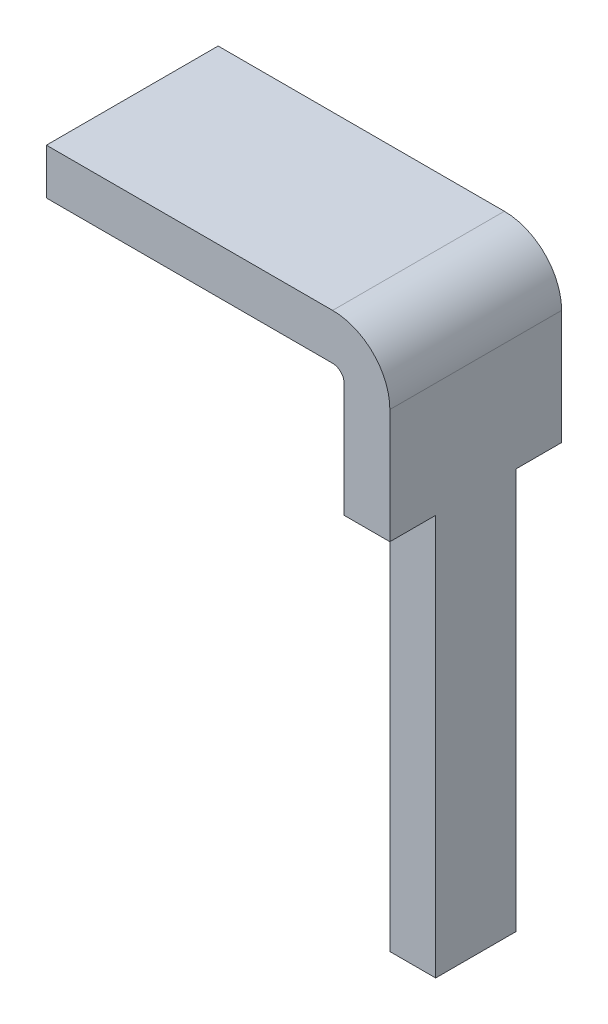
ISO-10303-21;
HEADER;
FILE_DESCRIPTION(('STEP AP214'),'2;1');
FILE_NAME('part.step','',(''),(''),'','','');
FILE_SCHEMA(('AUTOMOTIVE_DESIGN { 1 0 10303 214 1 1 1 1 }'));
ENDSEC;
DATA;
#1=APPLICATION_CONTEXT('core data for automotive mechanical design processes');
#2=APPLICATION_PROTOCOL_DEFINITION('international standard','automotive_design',2000,#1);
#3=PRODUCT_CONTEXT('',#1,'mechanical');
#4=PRODUCT('Part','Part','',(#3));
#5=PRODUCT_RELATED_PRODUCT_CATEGORY('part','',(#4));
#6=PRODUCT_DEFINITION_FORMATION('','',#4);
#7=PRODUCT_DEFINITION_CONTEXT('part definition',#1,'design');
#8=PRODUCT_DEFINITION('design','',#6,#7);
#9=PRODUCT_DEFINITION_SHAPE('','',#8);
#10=(LENGTH_UNIT() NAMED_UNIT(*) SI_UNIT(.MILLI.,.METRE.));
#11=(NAMED_UNIT(*) PLANE_ANGLE_UNIT() SI_UNIT($,.RADIAN.));
#12=(NAMED_UNIT(*) SI_UNIT($,.STERADIAN.) SOLID_ANGLE_UNIT());
#13=UNCERTAINTY_MEASURE_WITH_UNIT(LENGTH_MEASURE(1.E-05),#10,'distance_accuracy_value','');
#14=(GEOMETRIC_REPRESENTATION_CONTEXT(3) GLOBAL_UNCERTAINTY_ASSIGNED_CONTEXT((#13)) GLOBAL_UNIT_ASSIGNED_CONTEXT((#10,
#11,#12)) REPRESENTATION_CONTEXT('',''));
#15=CARTESIAN_POINT('',(0.,0.,0.));
#16=DIRECTION('',(0.,0.,1.));
#17=DIRECTION('',(1.,0.,0.));
#18=AXIS2_PLACEMENT_3D('',#15,#16,#17);
#19=CARTESIAN_POINT('',(0.,0.,1.5));
#20=DIRECTION('',(1.,0.,0.));
#21=DIRECTION('',(0.,0.,-1.));
#22=AXIS2_PLACEMENT_3D('',#19,#20,#21);
#23=PLANE('',#22);
#24=DIRECTION('',(0.,-1.,0.));
#25=VECTOR('',#24,1.);
#26=CARTESIAN_POINT('',(0.,0.,0.));
#27=LINE('',#26,#25);
#28=CARTESIAN_POINT('',(0.,0.,0.));
#29=VERTEX_POINT('',#28);
#30=CARTESIAN_POINT('',(0.,-0.4,0.));
#31=VERTEX_POINT('',#30);
#32=EDGE_CURVE('E189',#29,#31,#27,.T.);
#33=ORIENTED_EDGE('',*,*,#32,.T.);
#34=DIRECTION('',(0.,0.,-1.));
#35=VECTOR('',#34,1.);
#36=CARTESIAN_POINT('',(0.,-0.4,1.5));
#37=LINE('',#36,#35);
#38=CARTESIAN_POINT('',(0.,-0.4,1.5));
#39=VERTEX_POINT('',#38);
#40=EDGE_CURVE('E169',#39,#31,#37,.T.);
#41=ORIENTED_EDGE('',*,*,#40,.F.);
#42=DIRECTION('',(0.,-1.,0.));
#43=VECTOR('',#42,1.);
#44=CARTESIAN_POINT('',(0.,0.,1.5));
#45=LINE('',#44,#43);
#46=CARTESIAN_POINT('',(0.,0.,1.5));
#47=VERTEX_POINT('',#46);
#48=EDGE_CURVE('E148',#47,#39,#45,.T.);
#49=ORIENTED_EDGE('',*,*,#48,.F.);
#50=DIRECTION('',(0.,0.,-1.));
#51=VECTOR('',#50,1.);
#52=CARTESIAN_POINT('',(0.,0.,1.5));
#53=LINE('',#52,#51);
#54=EDGE_CURVE('E149',#47,#29,#53,.T.);
#55=ORIENTED_EDGE('',*,*,#54,.T.);
#56=EDGE_LOOP('',(#33,#41,#49,#55));
#57=FACE_BOUND('',#56,.T.);
#58=ADVANCED_FACE('F33',(#57),#23,.F.);
#59=CARTESIAN_POINT('',(0.,-0.4,1.5));
#60=DIRECTION('',(0.,1.,0.));
#61=DIRECTION('',(0.,0.,1.));
#62=AXIS2_PLACEMENT_3D('',#59,#60,#61);
#63=PLANE('',#62);
#64=DIRECTION('',(1.,0.,0.));
#65=VECTOR('',#64,1.);
#66=CARTESIAN_POINT('',(0.,-0.4,0.));
#67=LINE('',#66,#65);
#68=CARTESIAN_POINT('',(2.5,-0.4,0.));
#69=VERTEX_POINT('',#68);
#70=EDGE_CURVE('E192',#31,#69,#67,.T.);
#71=ORIENTED_EDGE('',*,*,#70,.T.);
#72=DIRECTION('',(0.,0.,-1.));
#73=VECTOR('',#72,1.);
#74=CARTESIAN_POINT('',(2.5,-0.4,1.5));
#75=LINE('',#74,#73);
#76=CARTESIAN_POINT('',(2.5,-0.4,1.5));
#77=VERTEX_POINT('',#76);
#78=EDGE_CURVE('E166',#77,#69,#75,.T.);
#79=ORIENTED_EDGE('',*,*,#78,.F.);
#80=DIRECTION('',(1.,0.,0.));
#81=VECTOR('',#80,1.);
#82=CARTESIAN_POINT('',(0.,-0.4,1.5));
#83=LINE('',#82,#81);
#84=EDGE_CURVE('E215',#39,#77,#83,.T.);
#85=ORIENTED_EDGE('',*,*,#84,.F.);
#86=ORIENTED_EDGE('',*,*,#40,.T.);
#87=EDGE_LOOP('',(#71,#79,#85,#86));
#88=FACE_BOUND('',#87,.T.);
#89=ADVANCED_FACE('F219',(#88),#63,.F.);
#90=CARTESIAN_POINT('',(2.5,-0.5,1.5));
#91=DIRECTION('',(0.,0.,-1.));
#92=DIRECTION('',(-1.,0.,0.));
#93=AXIS2_PLACEMENT_3D('',#90,#91,#92);
#94=CYLINDRICAL_SURFACE('',#93,0.0999999999999999);
#95=CARTESIAN_POINT('',(2.5,-0.5,0.));
#96=DIRECTION('',(0.,0.,-1.));
#97=DIRECTION('',(-1.,0.,0.));
#98=AXIS2_PLACEMENT_3D('',#95,#96,#97);
#99=CIRCLE('',#98,0.0999999999999999);
#100=CARTESIAN_POINT('',(2.6,-0.500000000000001,0.));
#101=VERTEX_POINT('',#100);
#102=EDGE_CURVE('E143',#69,#101,#99,.T.);
#103=ORIENTED_EDGE('',*,*,#102,.T.);
#104=DIRECTION('',(0.,0.,-1.));
#105=VECTOR('',#104,1.);
#106=CARTESIAN_POINT('',(2.6,-0.500000000000001,1.5));
#107=LINE('',#106,#105);
#108=CARTESIAN_POINT('',(2.6,-0.500000000000001,1.5));
#109=VERTEX_POINT('',#108);
#110=EDGE_CURVE('E163',#109,#101,#107,.T.);
#111=ORIENTED_EDGE('',*,*,#110,.F.);
#112=CARTESIAN_POINT('',(2.5,-0.5,1.5));
#113=DIRECTION('',(0.,0.,-1.));
#114=DIRECTION('',(-1.,0.,0.));
#115=AXIS2_PLACEMENT_3D('',#112,#113,#114);
#116=CIRCLE('',#115,0.0999999999999999);
#117=EDGE_CURVE('E184',#77,#109,#116,.T.);
#118=ORIENTED_EDGE('',*,*,#117,.F.);
#119=ORIENTED_EDGE('',*,*,#78,.T.);
#120=EDGE_LOOP('',(#103,#111,#118,#119));
#121=FACE_BOUND('',#120,.T.);
#122=ADVANCED_FACE('F197',(#121),#94,.F.);
#123=CARTESIAN_POINT('',(2.6,-0.500000000000001,1.5));
#124=DIRECTION('',(1.,0.,0.));
#125=DIRECTION('',(0.,0.,-1.));
#126=AXIS2_PLACEMENT_3D('',#123,#124,#125);
#127=PLANE('',#126);
#128=DIRECTION('',(0.,0.,1.));
#129=VECTOR('',#128,1.);
#130=CARTESIAN_POINT('',(2.6,-1.5,1.5));
#131=LINE('',#130,#129);
#132=CARTESIAN_POINT('',(2.6,-1.5,0.));
#133=VERTEX_POINT('',#132);
#134=CARTESIAN_POINT('',(2.6,-1.5,0.400000000000001));
#135=VERTEX_POINT('',#134);
#136=EDGE_CURVE('E46',#133,#135,#131,.T.);
#137=ORIENTED_EDGE('',*,*,#136,.T.);
#138=DIRECTION('',(0.,-1.,0.));
#139=VECTOR('',#138,1.);
#140=CARTESIAN_POINT('',(2.6,-0.500000000000001,0.400000000000001));
#141=LINE('',#140,#139);
#142=CARTESIAN_POINT('',(2.6,-5.,0.400000000000001));
#143=VERTEX_POINT('',#142);
#144=EDGE_CURVE('E258',#135,#143,#141,.T.);
#145=ORIENTED_EDGE('',*,*,#144,.T.);
#146=DIRECTION('',(0.,0.,-1.));
#147=VECTOR('',#146,1.);
#148=CARTESIAN_POINT('',(2.6,-5.,1.5));
#149=LINE('',#148,#147);
#150=CARTESIAN_POINT('',(2.6,-5.,1.1));
#151=VERTEX_POINT('',#150);
#152=EDGE_CURVE('E160',#151,#143,#149,.T.);
#153=ORIENTED_EDGE('',*,*,#152,.F.);
#154=DIRECTION('',(0.,1.,0.));
#155=VECTOR('',#154,1.);
#156=CARTESIAN_POINT('',(2.6,-0.500000000000001,1.1));
#157=LINE('',#156,#155);
#158=CARTESIAN_POINT('',(2.6,-1.5,1.1));
#159=VERTEX_POINT('',#158);
#160=EDGE_CURVE('E193',#151,#159,#157,.T.);
#161=ORIENTED_EDGE('',*,*,#160,.T.);
#162=DIRECTION('',(0.,0.,1.));
#163=VECTOR('',#162,1.);
#164=CARTESIAN_POINT('',(2.6,-1.5,1.5));
#165=LINE('',#164,#163);
#166=CARTESIAN_POINT('',(2.6,-1.5,1.5));
#167=VERTEX_POINT('',#166);
#168=EDGE_CURVE('E203',#159,#167,#165,.T.);
#169=ORIENTED_EDGE('',*,*,#168,.T.);
#170=DIRECTION('',(0.,-1.,0.));
#171=VECTOR('',#170,1.);
#172=CARTESIAN_POINT('',(2.6,-0.500000000000001,1.5));
#173=LINE('',#172,#171);
#174=EDGE_CURVE('E177',#109,#167,#173,.T.);
#175=ORIENTED_EDGE('',*,*,#174,.F.);
#176=ORIENTED_EDGE('',*,*,#110,.T.);
#177=DIRECTION('',(0.,-1.,0.));
#178=VECTOR('',#177,1.);
#179=CARTESIAN_POINT('',(2.6,-0.500000000000001,0.));
#180=LINE('',#179,#178);
#181=EDGE_CURVE('E139',#101,#133,#180,.T.);
#182=ORIENTED_EDGE('',*,*,#181,.T.);
#183=EDGE_LOOP('',(#137,#145,#153,#161,#169,#175,#176,#182));
#184=FACE_BOUND('',#183,.T.);
#185=ADVANCED_FACE('F201',(#184),#127,.F.);
#186=CARTESIAN_POINT('',(3.,-5.,1.5));
#187=DIRECTION('',(0.,1.,0.));
#188=DIRECTION('',(-1.,0.,0.));
#189=AXIS2_PLACEMENT_3D('',#186,#187,#188);
#190=PLANE('',#189);
#191=ORIENTED_EDGE('',*,*,#152,.T.);
#192=DIRECTION('',(1.,0.,0.));
#193=VECTOR('',#192,1.);
#194=CARTESIAN_POINT('',(1.5,-5.,0.400000000000001));
#195=LINE('',#194,#193);
#196=CARTESIAN_POINT('',(3.,-5.,0.400000000000001));
#197=VERTEX_POINT('',#196);
#198=EDGE_CURVE('E256',#143,#197,#195,.T.);
#199=ORIENTED_EDGE('',*,*,#198,.T.);
#200=DIRECTION('',(0.,0.,-1.));
#201=VECTOR('',#200,1.);
#202=CARTESIAN_POINT('',(3.,-5.,1.5));
#203=LINE('',#202,#201);
#204=CARTESIAN_POINT('',(3.,-5.,1.1));
#205=VERTEX_POINT('',#204);
#206=EDGE_CURVE('E158',#205,#197,#203,.T.);
#207=ORIENTED_EDGE('',*,*,#206,.F.);
#208=DIRECTION('',(1.,0.,0.));
#209=VECTOR('',#208,1.);
#210=CARTESIAN_POINT('',(1.5,-5.,1.1));
#211=LINE('',#210,#209);
#212=EDGE_CURVE('E209',#151,#205,#211,.T.);
#213=ORIENTED_EDGE('',*,*,#212,.F.);
#214=EDGE_LOOP('',(#191,#199,#207,#213));
#215=FACE_BOUND('',#214,.T.);
#216=ADVANCED_FACE('F236',(#215),#190,.F.);
#217=CARTESIAN_POINT('',(3.,-0.500000000000003,1.5));
#218=DIRECTION('',(-1.,0.,0.));
#219=DIRECTION('',(0.,-1.,0.));
#220=AXIS2_PLACEMENT_3D('',#217,#218,#219);
#221=PLANE('',#220);
#222=ORIENTED_EDGE('',*,*,#206,.T.);
#223=DIRECTION('',(0.,-1.,0.));
#224=VECTOR('',#223,1.);
#225=CARTESIAN_POINT('',(3.,-5.,0.400000000000001));
#226=LINE('',#225,#224);
#227=CARTESIAN_POINT('',(3.,-1.5,0.400000000000001));
#228=VERTEX_POINT('',#227);
#229=EDGE_CURVE('E133',#228,#197,#226,.T.);
#230=ORIENTED_EDGE('',*,*,#229,.F.);
#231=DIRECTION('',(0.,0.,1.));
#232=VECTOR('',#231,1.);
#233=CARTESIAN_POINT('',(3.,-1.5,0.));
#234=LINE('',#233,#232);
#235=CARTESIAN_POINT('',(3.,-1.5,0.));
#236=VERTEX_POINT('',#235);
#237=EDGE_CURVE('E121',#236,#228,#234,.T.);
#238=ORIENTED_EDGE('',*,*,#237,.F.);
#239=DIRECTION('',(0.,1.,0.));
#240=VECTOR('',#239,1.);
#241=CARTESIAN_POINT('',(3.,-0.500000000000003,0.));
#242=LINE('',#241,#240);
#243=CARTESIAN_POINT('',(3.,-0.500000000000003,0.));
#244=VERTEX_POINT('',#243);
#245=EDGE_CURVE('E131',#236,#244,#242,.T.);
#246=ORIENTED_EDGE('',*,*,#245,.T.);
#247=DIRECTION('',(0.,0.,-1.));
#248=VECTOR('',#247,1.);
#249=CARTESIAN_POINT('',(3.,-0.500000000000003,1.5));
#250=LINE('',#249,#248);
#251=CARTESIAN_POINT('',(3.,-0.500000000000003,1.5));
#252=VERTEX_POINT('',#251);
#253=EDGE_CURVE('E156',#252,#244,#250,.T.);
#254=ORIENTED_EDGE('',*,*,#253,.F.);
#255=DIRECTION('',(0.,1.,0.));
#256=VECTOR('',#255,1.);
#257=CARTESIAN_POINT('',(3.,-0.500000000000003,1.5));
#258=LINE('',#257,#256);
#259=CARTESIAN_POINT('',(3.,-1.5,1.5));
#260=VERTEX_POINT('',#259);
#261=EDGE_CURVE('E175',#260,#252,#258,.T.);
#262=ORIENTED_EDGE('',*,*,#261,.F.);
#263=DIRECTION('',(0.,0.,1.));
#264=VECTOR('',#263,1.);
#265=CARTESIAN_POINT('',(3.,-1.5,1.5));
#266=LINE('',#265,#264);
#267=CARTESIAN_POINT('',(3.,-1.5,1.1));
#268=VERTEX_POINT('',#267);
#269=EDGE_CURVE('E54',#268,#260,#266,.T.);
#270=ORIENTED_EDGE('',*,*,#269,.F.);
#271=DIRECTION('',(0.,1.,0.));
#272=VECTOR('',#271,1.);
#273=CARTESIAN_POINT('',(3.,-5.,1.1));
#274=LINE('',#273,#272);
#275=EDGE_CURVE('E260',#205,#268,#274,.T.);
#276=ORIENTED_EDGE('',*,*,#275,.F.);
#277=EDGE_LOOP('',(#222,#230,#238,#246,#254,#262,#270,#276));
#278=FACE_BOUND('',#277,.T.);
#279=ADVANCED_FACE('F129',(#278),#221,.F.);
#280=CARTESIAN_POINT('',(2.5,-0.5,1.5));
#281=DIRECTION('',(0.,0.,-1.));
#282=DIRECTION('',(-1.,0.,0.));
#283=AXIS2_PLACEMENT_3D('',#280,#281,#282);
#284=CYLINDRICAL_SURFACE('',#283,0.5);
#285=CARTESIAN_POINT('',(2.5,-0.5,0.));
#286=DIRECTION('',(0.,0.,1.));
#287=DIRECTION('',(-1.,0.,0.));
#288=AXIS2_PLACEMENT_3D('',#285,#286,#287);
#289=CIRCLE('',#288,0.5);
#290=CARTESIAN_POINT('',(2.5,0.,0.));
#291=VERTEX_POINT('',#290);
#292=EDGE_CURVE('E138',#244,#291,#289,.T.);
#293=ORIENTED_EDGE('',*,*,#292,.T.);
#294=DIRECTION('',(0.,0.,-1.));
#295=VECTOR('',#294,1.);
#296=CARTESIAN_POINT('',(2.5,0.,1.5));
#297=LINE('',#296,#295);
#298=CARTESIAN_POINT('',(2.5,0.,1.5));
#299=VERTEX_POINT('',#298);
#300=EDGE_CURVE('E152',#299,#291,#297,.T.);
#301=ORIENTED_EDGE('',*,*,#300,.F.);
#302=CARTESIAN_POINT('',(2.5,-0.5,1.5));
#303=DIRECTION('',(0.,0.,1.));
#304=DIRECTION('',(-1.,0.,0.));
#305=AXIS2_PLACEMENT_3D('',#302,#303,#304);
#306=CIRCLE('',#305,0.5);
#307=EDGE_CURVE('E181',#252,#299,#306,.T.);
#308=ORIENTED_EDGE('',*,*,#307,.F.);
#309=ORIENTED_EDGE('',*,*,#253,.T.);
#310=EDGE_LOOP('',(#293,#301,#308,#309));
#311=FACE_BOUND('',#310,.T.);
#312=ADVANCED_FACE('F228',(#311),#284,.T.);
#313=CARTESIAN_POINT('',(0.,0.,1.5));
#314=DIRECTION('',(0.,-1.,0.));
#315=DIRECTION('',(0.,0.,-1.));
#316=AXIS2_PLACEMENT_3D('',#313,#314,#315);
#317=PLANE('',#316);
#318=DIRECTION('',(-1.,0.,0.));
#319=VECTOR('',#318,1.);
#320=CARTESIAN_POINT('',(0.,0.,0.));
#321=LINE('',#320,#319);
#322=EDGE_CURVE('E141',#291,#29,#321,.T.);
#323=ORIENTED_EDGE('',*,*,#322,.T.);
#324=ORIENTED_EDGE('',*,*,#54,.F.);
#325=DIRECTION('',(-1.,0.,0.));
#326=VECTOR('',#325,1.);
#327=CARTESIAN_POINT('',(0.,0.,1.5));
#328=LINE('',#327,#326);
#329=EDGE_CURVE('E153',#299,#47,#328,.T.);
#330=ORIENTED_EDGE('',*,*,#329,.F.);
#331=ORIENTED_EDGE('',*,*,#300,.T.);
#332=EDGE_LOOP('',(#323,#324,#330,#331));
#333=FACE_BOUND('',#332,.T.);
#334=ADVANCED_FACE('F225',(#333),#317,.F.);
#335=CARTESIAN_POINT('',(2.5,-0.5,1.5));
#336=DIRECTION('',(0.,0.,-1.));
#337=DIRECTION('',(-1.,0.,0.));
#338=AXIS2_PLACEMENT_3D('',#335,#336,#337);
#339=PLANE('',#338);
#340=ORIENTED_EDGE('',*,*,#174,.T.);
#341=DIRECTION('',(1.,0.,0.));
#342=VECTOR('',#341,1.);
#343=CARTESIAN_POINT('',(2.5,-1.5,1.5));
#344=LINE('',#343,#342);
#345=EDGE_CURVE('E40',#167,#260,#344,.T.);
#346=ORIENTED_EDGE('',*,*,#345,.T.);
#347=ORIENTED_EDGE('',*,*,#261,.T.);
#348=ORIENTED_EDGE('',*,*,#307,.T.);
#349=ORIENTED_EDGE('',*,*,#329,.T.);
#350=ORIENTED_EDGE('',*,*,#48,.T.);
#351=ORIENTED_EDGE('',*,*,#84,.T.);
#352=ORIENTED_EDGE('',*,*,#117,.T.);
#353=EDGE_LOOP('',(#340,#346,#347,#348,#349,#350,#351,#352));
#354=FACE_BOUND('',#353,.T.);
#355=ADVANCED_FACE('F174',(#354),#339,.F.);
#356=CARTESIAN_POINT('',(2.5,-0.5,0.));
#357=DIRECTION('',(0.,0.,-1.));
#358=DIRECTION('',(-1.,0.,0.));
#359=AXIS2_PLACEMENT_3D('',#356,#357,#358);
#360=PLANE('',#359);
#361=DIRECTION('',(1.,0.,0.));
#362=VECTOR('',#361,1.);
#363=CARTESIAN_POINT('',(2.5,-1.5,0.));
#364=LINE('',#363,#362);
#365=EDGE_CURVE('E11',#133,#236,#364,.T.);
#366=ORIENTED_EDGE('',*,*,#365,.F.);
#367=ORIENTED_EDGE('',*,*,#181,.F.);
#368=ORIENTED_EDGE('',*,*,#102,.F.);
#369=ORIENTED_EDGE('',*,*,#70,.F.);
#370=ORIENTED_EDGE('',*,*,#32,.F.);
#371=ORIENTED_EDGE('',*,*,#322,.F.);
#372=ORIENTED_EDGE('',*,*,#292,.F.);
#373=ORIENTED_EDGE('',*,*,#245,.F.);
#374=EDGE_LOOP('',(#366,#367,#368,#369,#370,#371,#372,#373));
#375=FACE_BOUND('',#374,.T.);
#376=ADVANCED_FACE('F136',(#375),#360,.T.);
#377=CARTESIAN_POINT('',(1.5,-5.,1.1));
#378=DIRECTION('',(0.,0.,-1.));
#379=DIRECTION('',(-1.,0.,0.));
#380=AXIS2_PLACEMENT_3D('',#377,#378,#379);
#381=PLANE('',#380);
#382=ORIENTED_EDGE('',*,*,#212,.T.);
#383=ORIENTED_EDGE('',*,*,#275,.T.);
#384=DIRECTION('',(1.,0.,0.));
#385=VECTOR('',#384,1.);
#386=CARTESIAN_POINT('',(1.5,-1.5,1.1));
#387=LINE('',#386,#385);
#388=EDGE_CURVE('E206',#159,#268,#387,.T.);
#389=ORIENTED_EDGE('',*,*,#388,.F.);
#390=ORIENTED_EDGE('',*,*,#160,.F.);
#391=EDGE_LOOP('',(#382,#383,#389,#390));
#392=FACE_BOUND('',#391,.T.);
#393=ADVANCED_FACE('F268',(#392),#381,.F.);
#394=CARTESIAN_POINT('',(1.5,-1.5,1.5));
#395=DIRECTION('',(0.,1.,0.));
#396=DIRECTION('',(-1.,0.,0.));
#397=AXIS2_PLACEMENT_3D('',#394,#395,#396);
#398=PLANE('',#397);
#399=ORIENTED_EDGE('',*,*,#388,.T.);
#400=ORIENTED_EDGE('',*,*,#269,.T.);
#401=ORIENTED_EDGE('',*,*,#345,.F.);
#402=ORIENTED_EDGE('',*,*,#168,.F.);
#403=EDGE_LOOP('',(#399,#400,#401,#402));
#404=FACE_BOUND('',#403,.T.);
#405=ADVANCED_FACE('F269',(#404),#398,.F.);
#406=CARTESIAN_POINT('',(1.5,-5.,0.400000000000001));
#407=DIRECTION('',(0.,0.,1.));
#408=DIRECTION('',(1.,0.,0.));
#409=AXIS2_PLACEMENT_3D('',#406,#407,#408);
#410=PLANE('',#409);
#411=DIRECTION('',(1.,0.,0.));
#412=VECTOR('',#411,1.);
#413=CARTESIAN_POINT('',(1.5,-1.5,0.400000000000001));
#414=LINE('',#413,#412);
#415=EDGE_CURVE('E359',#135,#228,#414,.T.);
#416=ORIENTED_EDGE('',*,*,#415,.T.);
#417=ORIENTED_EDGE('',*,*,#229,.T.);
#418=ORIENTED_EDGE('',*,*,#198,.F.);
#419=ORIENTED_EDGE('',*,*,#144,.F.);
#420=EDGE_LOOP('',(#416,#417,#418,#419));
#421=FACE_BOUND('',#420,.T.);
#422=ADVANCED_FACE('F271',(#421),#410,.F.);
#423=CARTESIAN_POINT('',(1.5,-1.5,0.));
#424=DIRECTION('',(0.,1.,0.));
#425=DIRECTION('',(-1.,0.,0.));
#426=AXIS2_PLACEMENT_3D('',#423,#424,#425);
#427=PLANE('',#426);
#428=ORIENTED_EDGE('',*,*,#365,.T.);
#429=ORIENTED_EDGE('',*,*,#237,.T.);
#430=ORIENTED_EDGE('',*,*,#415,.F.);
#431=ORIENTED_EDGE('',*,*,#136,.F.);
#432=EDGE_LOOP('',(#428,#429,#430,#431));
#433=FACE_BOUND('',#432,.T.);
#434=ADVANCED_FACE('F120',(#433),#427,.F.);
#435=CLOSED_SHELL('',(#58,#89,#122,#185,#216,#279,#312,#334,#355,#376,#393,#405,#422,#434));
#436=MANIFOLD_SOLID_BREP('B2',#435);
#437=ADVANCED_BREP_SHAPE_REPRESENTATION('',(#18,#436),#14);
#438=SHAPE_DEFINITION_REPRESENTATION(#9,#437);
ENDSEC;
END-ISO-10303-21;
